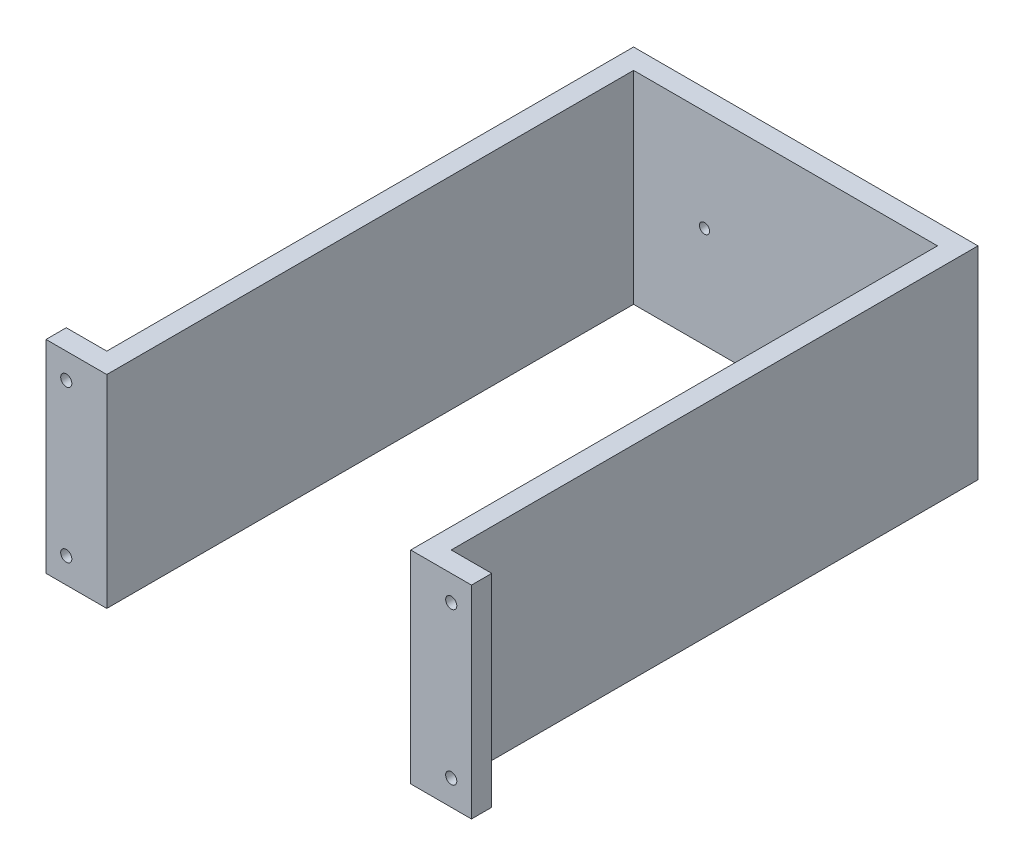
ISO-10303-21;
HEADER;
FILE_DESCRIPTION(('STEP AP214'),'2;1');
FILE_NAME('part.step','',(''),(''),'','','');
FILE_SCHEMA(('AUTOMOTIVE_DESIGN { 1 0 10303 214 1 1 1 1 }'));
ENDSEC;
DATA;
#1=APPLICATION_CONTEXT('core data for automotive mechanical design processes');
#2=APPLICATION_PROTOCOL_DEFINITION('international standard','automotive_design',2000,#1);
#3=PRODUCT_CONTEXT('',#1,'mechanical');
#4=PRODUCT('Part','Part','',(#3));
#5=PRODUCT_RELATED_PRODUCT_CATEGORY('part','',(#4));
#6=PRODUCT_DEFINITION_FORMATION('','',#4);
#7=PRODUCT_DEFINITION_CONTEXT('part definition',#1,'design');
#8=PRODUCT_DEFINITION('design','',#6,#7);
#9=PRODUCT_DEFINITION_SHAPE('','',#8);
#10=(LENGTH_UNIT() NAMED_UNIT(*) SI_UNIT(.MILLI.,.METRE.));
#11=(NAMED_UNIT(*) PLANE_ANGLE_UNIT() SI_UNIT($,.RADIAN.));
#12=(NAMED_UNIT(*) SI_UNIT($,.STERADIAN.) SOLID_ANGLE_UNIT());
#13=UNCERTAINTY_MEASURE_WITH_UNIT(LENGTH_MEASURE(1.E-05),#10,'distance_accuracy_value','');
#14=(GEOMETRIC_REPRESENTATION_CONTEXT(3) GLOBAL_UNCERTAINTY_ASSIGNED_CONTEXT((#13)) GLOBAL_UNIT_ASSIGNED_CONTEXT((#10,
#11,#12)) REPRESENTATION_CONTEXT('',''));
#15=CARTESIAN_POINT('',(0.,0.,0.));
#16=DIRECTION('',(0.,0.,1.));
#17=DIRECTION('',(1.,0.,0.));
#18=AXIS2_PLACEMENT_3D('',#15,#16,#17);
#19=CARTESIAN_POINT('',(9.99999999999999,87.5,0.));
#20=DIRECTION('',(0.,0.,-1.));
#21=DIRECTION('',(-1.,0.,0.));
#22=AXIS2_PLACEMENT_3D('',#19,#20,#21);
#23=CYLINDRICAL_SURFACE('',#22,2.75);
#24=CARTESIAN_POINT('',(9.99999999999999,87.5,0.));
#25=DIRECTION('',(0.,0.,-1.));
#26=DIRECTION('',(-1.,0.,0.));
#27=AXIS2_PLACEMENT_3D('',#24,#25,#26);
#28=CIRCLE('',#27,2.75);
#29=CARTESIAN_POINT('',(7.24999999999999,87.5,0.));
#30=VERTEX_POINT('',#29);
#31=EDGE_CURVE('E288',#30,#30,#28,.T.);
#32=ORIENTED_EDGE('',*,*,#31,.F.);
#33=EDGE_LOOP('',(#32));
#34=FACE_BOUND('',#33,.T.);
#35=CARTESIAN_POINT('',(9.99999999999999,87.5,-4.5));
#36=DIRECTION('',(0.,0.,-1.));
#37=DIRECTION('',(-1.,0.,0.));
#38=AXIS2_PLACEMENT_3D('',#35,#36,#37);
#39=CIRCLE('',#38,2.75);
#40=CARTESIAN_POINT('',(7.24999999999999,87.5,-4.5));
#41=VERTEX_POINT('',#40);
#42=EDGE_CURVE('E51',#41,#41,#39,.F.);
#43=ORIENTED_EDGE('',*,*,#42,.F.);
#44=EDGE_LOOP('',(#43));
#45=FACE_BOUND('',#44,.T.);
#46=ADVANCED_FACE('F47',(#34,#45),#23,.F.);
#47=CARTESIAN_POINT('',(10.,12.5,0.));
#48=DIRECTION('',(0.,0.,-1.));
#49=DIRECTION('',(-1.,0.,0.));
#50=AXIS2_PLACEMENT_3D('',#47,#48,#49);
#51=CYLINDRICAL_SURFACE('',#50,2.75);
#52=CARTESIAN_POINT('',(10.,12.5,0.));
#53=DIRECTION('',(0.,0.,-1.));
#54=DIRECTION('',(-1.,0.,0.));
#55=AXIS2_PLACEMENT_3D('',#52,#53,#54);
#56=CIRCLE('',#55,2.75);
#57=CARTESIAN_POINT('',(7.25000000000001,12.5,0.));
#58=VERTEX_POINT('',#57);
#59=EDGE_CURVE('E284',#58,#58,#56,.T.);
#60=ORIENTED_EDGE('',*,*,#59,.F.);
#61=EDGE_LOOP('',(#60));
#62=FACE_BOUND('',#61,.T.);
#63=CARTESIAN_POINT('',(10.,12.5,-4.5));
#64=DIRECTION('',(0.,0.,-1.));
#65=DIRECTION('',(-1.,0.,0.));
#66=AXIS2_PLACEMENT_3D('',#63,#64,#65);
#67=CIRCLE('',#66,2.75);
#68=CARTESIAN_POINT('',(7.25000000000001,12.5,-4.5));
#69=VERTEX_POINT('',#68);
#70=EDGE_CURVE('E263',#69,#69,#67,.F.);
#71=ORIENTED_EDGE('',*,*,#70,.F.);
#72=EDGE_LOOP('',(#71));
#73=FACE_BOUND('',#72,.T.);
#74=ADVANCED_FACE('F433',(#62,#73),#51,.F.);
#75=CARTESIAN_POINT('',(200.,12.5000000000001,0.));
#76=DIRECTION('',(0.,0.,-1.));
#77=DIRECTION('',(-1.,0.,0.));
#78=AXIS2_PLACEMENT_3D('',#75,#76,#77);
#79=CYLINDRICAL_SURFACE('',#78,2.75000000000001);
#80=CARTESIAN_POINT('',(200.,12.5000000000001,0.));
#81=DIRECTION('',(0.,0.,-1.));
#82=DIRECTION('',(-1.,0.,0.));
#83=AXIS2_PLACEMENT_3D('',#80,#81,#82);
#84=CIRCLE('',#83,2.75000000000001);
#85=CARTESIAN_POINT('',(197.25,12.5000000000001,0.));
#86=VERTEX_POINT('',#85);
#87=EDGE_CURVE('E277',#86,#86,#84,.T.);
#88=ORIENTED_EDGE('',*,*,#87,.F.);
#89=EDGE_LOOP('',(#88));
#90=FACE_BOUND('',#89,.T.);
#91=CARTESIAN_POINT('',(200.,12.5000000000001,-4.5));
#92=DIRECTION('',(0.,0.,-1.));
#93=DIRECTION('',(-1.,0.,0.));
#94=AXIS2_PLACEMENT_3D('',#91,#92,#93);
#95=CIRCLE('',#94,2.75000000000001);
#96=CARTESIAN_POINT('',(197.25,12.5000000000001,-4.5));
#97=VERTEX_POINT('',#96);
#98=EDGE_CURVE('E259',#97,#97,#95,.F.);
#99=ORIENTED_EDGE('',*,*,#98,.F.);
#100=EDGE_LOOP('',(#99));
#101=FACE_BOUND('',#100,.T.);
#102=ADVANCED_FACE('F439',(#90,#101),#79,.F.);
#103=CARTESIAN_POINT('',(200.,87.5,0.));
#104=DIRECTION('',(0.,0.,-1.));
#105=DIRECTION('',(-1.,0.,0.));
#106=AXIS2_PLACEMENT_3D('',#103,#104,#105);
#107=CYLINDRICAL_SURFACE('',#106,2.75000000000001);
#108=CARTESIAN_POINT('',(200.,87.5,0.));
#109=DIRECTION('',(0.,0.,-1.));
#110=DIRECTION('',(-1.,0.,0.));
#111=AXIS2_PLACEMENT_3D('',#108,#109,#110);
#112=CIRCLE('',#111,2.75000000000001);
#113=CARTESIAN_POINT('',(197.25,87.5,0.));
#114=VERTEX_POINT('',#113);
#115=EDGE_CURVE('E271',#114,#114,#112,.T.);
#116=ORIENTED_EDGE('',*,*,#115,.F.);
#117=EDGE_LOOP('',(#116));
#118=FACE_BOUND('',#117,.T.);
#119=CARTESIAN_POINT('',(200.,87.5,-4.5));
#120=DIRECTION('',(0.,0.,-1.));
#121=DIRECTION('',(-1.,0.,0.));
#122=AXIS2_PLACEMENT_3D('',#119,#120,#121);
#123=CIRCLE('',#122,2.75000000000001);
#124=CARTESIAN_POINT('',(197.25,87.5,-4.5));
#125=VERTEX_POINT('',#124);
#126=EDGE_CURVE('E255',#125,#125,#123,.F.);
#127=ORIENTED_EDGE('',*,*,#126,.F.);
#128=EDGE_LOOP('',(#127));
#129=FACE_BOUND('',#128,.T.);
#130=ADVANCED_FACE('F445',(#118,#129),#107,.F.);
#131=CARTESIAN_POINT('',(65.,50.,-270.));
#132=DIRECTION('',(0.,0.,-1.));
#133=DIRECTION('',(-1.,0.,0.));
#134=AXIS2_PLACEMENT_3D('',#131,#132,#133);
#135=CYLINDRICAL_SURFACE('',#134,2.5);
#136=CARTESIAN_POINT('',(65.,50.,-260.));
#137=DIRECTION('',(0.,0.,-1.));
#138=DIRECTION('',(-1.,0.,0.));
#139=AXIS2_PLACEMENT_3D('',#136,#137,#138);
#140=CIRCLE('',#139,2.5);
#141=CARTESIAN_POINT('',(62.5,50.,-260.));
#142=VERTEX_POINT('',#141);
#143=EDGE_CURVE('E181',#142,#142,#140,.T.);
#144=ORIENTED_EDGE('',*,*,#143,.F.);
#145=EDGE_LOOP('',(#144));
#146=FACE_BOUND('',#145,.T.);
#147=CARTESIAN_POINT('',(65.,50.,-267.4));
#148=DIRECTION('',(0.,0.,-1.));
#149=DIRECTION('',(-1.,0.,0.));
#150=AXIS2_PLACEMENT_3D('',#147,#148,#149);
#151=CIRCLE('',#150,2.5);
#152=CARTESIAN_POINT('',(62.5,50.,-267.4));
#153=VERTEX_POINT('',#152);
#154=EDGE_CURVE('E249',#153,#153,#151,.F.);
#155=ORIENTED_EDGE('',*,*,#154,.F.);
#156=EDGE_LOOP('',(#155));
#157=FACE_BOUND('',#156,.T.);
#158=ADVANCED_FACE('F468',(#146,#157),#135,.F.);
#159=CARTESIAN_POINT('',(145.,50.0000000000001,-270.));
#160=DIRECTION('',(0.,0.,-1.));
#161=DIRECTION('',(-1.,0.,0.));
#162=AXIS2_PLACEMENT_3D('',#159,#160,#161);
#163=CYLINDRICAL_SURFACE('',#162,2.5);
#164=CARTESIAN_POINT('',(145.,50.0000000000001,-260.));
#165=DIRECTION('',(0.,0.,-1.));
#166=DIRECTION('',(-1.,0.,0.));
#167=AXIS2_PLACEMENT_3D('',#164,#165,#166);
#168=CIRCLE('',#167,2.5);
#169=CARTESIAN_POINT('',(142.5,50.0000000000001,-260.));
#170=VERTEX_POINT('',#169);
#171=EDGE_CURVE('E254',#170,#170,#168,.T.);
#172=ORIENTED_EDGE('',*,*,#171,.F.);
#173=EDGE_LOOP('',(#172));
#174=FACE_BOUND('',#173,.T.);
#175=CARTESIAN_POINT('',(145.,50.0000000000001,-267.4));
#176=DIRECTION('',(0.,0.,-1.));
#177=DIRECTION('',(-1.,0.,0.));
#178=AXIS2_PLACEMENT_3D('',#175,#176,#177);
#179=CIRCLE('',#178,2.5);
#180=CARTESIAN_POINT('',(142.5,50.0000000000001,-267.4));
#181=VERTEX_POINT('',#180);
#182=EDGE_CURVE('E245',#181,#181,#179,.F.);
#183=ORIENTED_EDGE('',*,*,#182,.F.);
#184=EDGE_LOOP('',(#183));
#185=FACE_BOUND('',#184,.T.);
#186=ADVANCED_FACE('F465',(#174,#185),#163,.F.);
#187=CARTESIAN_POINT('',(0.,100.,0.));
#188=DIRECTION('',(1.,0.,0.));
#189=DIRECTION('',(0.,0.,-1.));
#190=AXIS2_PLACEMENT_3D('',#187,#188,#189);
#191=PLANE('',#190);
#192=DIRECTION('',(0.,0.,1.));
#193=VECTOR('',#192,1.);
#194=CARTESIAN_POINT('',(0.,0.,0.));
#195=LINE('',#194,#193);
#196=CARTESIAN_POINT('',(0.,0.,-10.));
#197=VERTEX_POINT('',#196);
#198=CARTESIAN_POINT('',(0.,0.,0.));
#199=VERTEX_POINT('',#198);
#200=EDGE_CURVE('E176',#197,#199,#195,.T.);
#201=ORIENTED_EDGE('',*,*,#200,.T.);
#202=DIRECTION('',(0.,-1.,0.));
#203=VECTOR('',#202,1.);
#204=CARTESIAN_POINT('',(0.,100.,0.));
#205=LINE('',#204,#203);
#206=CARTESIAN_POINT('',(0.,100.,0.));
#207=VERTEX_POINT('',#206);
#208=EDGE_CURVE('E11',#207,#199,#205,.T.);
#209=ORIENTED_EDGE('',*,*,#208,.F.);
#210=DIRECTION('',(0.,0.,1.));
#211=VECTOR('',#210,1.);
#212=CARTESIAN_POINT('',(0.,100.,0.));
#213=LINE('',#212,#211);
#214=CARTESIAN_POINT('',(0.,100.,-10.));
#215=VERTEX_POINT('',#214);
#216=EDGE_CURVE('E211',#215,#207,#213,.T.);
#217=ORIENTED_EDGE('',*,*,#216,.F.);
#218=DIRECTION('',(0.,-1.,0.));
#219=VECTOR('',#218,1.);
#220=CARTESIAN_POINT('',(0.,100.,-10.));
#221=LINE('',#220,#219);
#222=EDGE_CURVE('E172',#215,#197,#221,.T.);
#223=ORIENTED_EDGE('',*,*,#222,.T.);
#224=EDGE_LOOP('',(#201,#209,#217,#223));
#225=FACE_BOUND('',#224,.T.);
#226=ADVANCED_FACE('F49',(#225),#191,.F.);
#227=CARTESIAN_POINT('',(0.,100.,0.));
#228=DIRECTION('',(0.,0.,-1.));
#229=DIRECTION('',(-1.,0.,0.));
#230=AXIS2_PLACEMENT_3D('',#227,#228,#229);
#231=PLANE('',#230);
#232=ORIENTED_EDGE('',*,*,#59,.T.);
#233=EDGE_LOOP('',(#232));
#234=FACE_BOUND('',#233,.T.);
#235=ORIENTED_EDGE('',*,*,#31,.T.);
#236=EDGE_LOOP('',(#235));
#237=FACE_BOUND('',#236,.T.);
#238=DIRECTION('',(1.,0.,0.));
#239=VECTOR('',#238,1.);
#240=CARTESIAN_POINT('',(0.,0.,0.));
#241=LINE('',#240,#239);
#242=CARTESIAN_POINT('',(30.,0.,0.));
#243=VERTEX_POINT('',#242);
#244=EDGE_CURVE('E180',#199,#243,#241,.T.);
#245=ORIENTED_EDGE('',*,*,#244,.T.);
#246=DIRECTION('',(0.,-1.,0.));
#247=VECTOR('',#246,1.);
#248=CARTESIAN_POINT('',(30.,100.,0.));
#249=LINE('',#248,#247);
#250=CARTESIAN_POINT('',(30.,100.,0.));
#251=VERTEX_POINT('',#250);
#252=EDGE_CURVE('E58',#251,#243,#249,.T.);
#253=ORIENTED_EDGE('',*,*,#252,.F.);
#254=DIRECTION('',(1.,0.,0.));
#255=VECTOR('',#254,1.);
#256=CARTESIAN_POINT('',(0.,100.,0.));
#257=LINE('',#256,#255);
#258=EDGE_CURVE('E122',#207,#251,#257,.T.);
#259=ORIENTED_EDGE('',*,*,#258,.F.);
#260=ORIENTED_EDGE('',*,*,#208,.T.);
#261=EDGE_LOOP('',(#245,#253,#259,#260));
#262=FACE_BOUND('',#261,.T.);
#263=ADVANCED_FACE('F508',(#234,#237,#262),#231,.F.);
#264=CARTESIAN_POINT('',(30.,100.,0.));
#265=DIRECTION('',(-1.,0.,0.));
#266=DIRECTION('',(0.,0.,1.));
#267=AXIS2_PLACEMENT_3D('',#264,#265,#266);
#268=PLANE('',#267);
#269=DIRECTION('',(0.,0.,-1.));
#270=VECTOR('',#269,1.);
#271=CARTESIAN_POINT('',(30.,0.,0.));
#272=LINE('',#271,#270);
#273=CARTESIAN_POINT('',(30.,0.,-260.));
#274=VERTEX_POINT('',#273);
#275=EDGE_CURVE('E184',#243,#274,#272,.T.);
#276=ORIENTED_EDGE('',*,*,#275,.T.);
#277=DIRECTION('',(0.,-1.,0.));
#278=VECTOR('',#277,1.);
#279=CARTESIAN_POINT('',(30.,100.,-260.));
#280=LINE('',#279,#278);
#281=CARTESIAN_POINT('',(30.,100.,-260.));
#282=VERTEX_POINT('',#281);
#283=EDGE_CURVE('E238',#282,#274,#280,.T.);
#284=ORIENTED_EDGE('',*,*,#283,.F.);
#285=DIRECTION('',(0.,0.,-1.));
#286=VECTOR('',#285,1.);
#287=CARTESIAN_POINT('',(30.,100.,0.));
#288=LINE('',#287,#286);
#289=EDGE_CURVE('E317',#251,#282,#288,.T.);
#290=ORIENTED_EDGE('',*,*,#289,.F.);
#291=ORIENTED_EDGE('',*,*,#252,.T.);
#292=EDGE_LOOP('',(#276,#284,#290,#291));
#293=FACE_BOUND('',#292,.T.);
#294=ADVANCED_FACE('F505',(#293),#268,.F.);
#295=CARTESIAN_POINT('',(30.,100.,-260.));
#296=DIRECTION('',(0.,0.,-1.));
#297=DIRECTION('',(-1.,0.,0.));
#298=AXIS2_PLACEMENT_3D('',#295,#296,#297);
#299=PLANE('',#298);
#300=ORIENTED_EDGE('',*,*,#171,.T.);
#301=EDGE_LOOP('',(#300));
#302=FACE_BOUND('',#301,.T.);
#303=ORIENTED_EDGE('',*,*,#143,.T.);
#304=EDGE_LOOP('',(#303));
#305=FACE_BOUND('',#304,.T.);
#306=DIRECTION('',(1.,0.,0.));
#307=VECTOR('',#306,1.);
#308=CARTESIAN_POINT('',(30.,0.,-260.));
#309=LINE('',#308,#307);
#310=CARTESIAN_POINT('',(180.,0.,-260.));
#311=VERTEX_POINT('',#310);
#312=EDGE_CURVE('E187',#274,#311,#309,.T.);
#313=ORIENTED_EDGE('',*,*,#312,.T.);
#314=DIRECTION('',(0.,-1.,0.));
#315=VECTOR('',#314,1.);
#316=CARTESIAN_POINT('',(180.,100.,-260.));
#317=LINE('',#316,#315);
#318=CARTESIAN_POINT('',(180.,100.,-260.));
#319=VERTEX_POINT('',#318);
#320=EDGE_CURVE('E234',#319,#311,#317,.T.);
#321=ORIENTED_EDGE('',*,*,#320,.F.);
#322=DIRECTION('',(1.,0.,0.));
#323=VECTOR('',#322,1.);
#324=CARTESIAN_POINT('',(30.,100.,-260.));
#325=LINE('',#324,#323);
#326=EDGE_CURVE('E320',#282,#319,#325,.T.);
#327=ORIENTED_EDGE('',*,*,#326,.F.);
#328=ORIENTED_EDGE('',*,*,#283,.T.);
#329=EDGE_LOOP('',(#313,#321,#327,#328));
#330=FACE_BOUND('',#329,.T.);
#331=ADVANCED_FACE('F501',(#302,#305,#330),#299,.F.);
#332=CARTESIAN_POINT('',(180.,100.,-260.));
#333=DIRECTION('',(1.,0.,0.));
#334=DIRECTION('',(0.,0.,-1.));
#335=AXIS2_PLACEMENT_3D('',#332,#333,#334);
#336=PLANE('',#335);
#337=DIRECTION('',(0.,0.,1.));
#338=VECTOR('',#337,1.);
#339=CARTESIAN_POINT('',(180.,0.,-260.));
#340=LINE('',#339,#338);
#341=CARTESIAN_POINT('',(180.,0.,0.));
#342=VERTEX_POINT('',#341);
#343=EDGE_CURVE('E190',#311,#342,#340,.T.);
#344=ORIENTED_EDGE('',*,*,#343,.T.);
#345=DIRECTION('',(0.,-1.,0.));
#346=VECTOR('',#345,1.);
#347=CARTESIAN_POINT('',(180.,100.,0.));
#348=LINE('',#347,#346);
#349=CARTESIAN_POINT('',(180.,100.,0.));
#350=VERTEX_POINT('',#349);
#351=EDGE_CURVE('E230',#350,#342,#348,.T.);
#352=ORIENTED_EDGE('',*,*,#351,.F.);
#353=DIRECTION('',(0.,0.,1.));
#354=VECTOR('',#353,1.);
#355=CARTESIAN_POINT('',(180.,100.,-260.));
#356=LINE('',#355,#354);
#357=EDGE_CURVE('E323',#319,#350,#356,.T.);
#358=ORIENTED_EDGE('',*,*,#357,.F.);
#359=ORIENTED_EDGE('',*,*,#320,.T.);
#360=EDGE_LOOP('',(#344,#352,#358,#359));
#361=FACE_BOUND('',#360,.T.);
#362=ADVANCED_FACE('F498',(#361),#336,.F.);
#363=CARTESIAN_POINT('',(180.,100.,0.));
#364=DIRECTION('',(0.,0.,-1.));
#365=DIRECTION('',(-1.,0.,0.));
#366=AXIS2_PLACEMENT_3D('',#363,#364,#365);
#367=PLANE('',#366);
#368=ORIENTED_EDGE('',*,*,#115,.T.);
#369=EDGE_LOOP('',(#368));
#370=FACE_BOUND('',#369,.T.);
#371=ORIENTED_EDGE('',*,*,#87,.T.);
#372=EDGE_LOOP('',(#371));
#373=FACE_BOUND('',#372,.T.);
#374=DIRECTION('',(1.,0.,0.));
#375=VECTOR('',#374,1.);
#376=CARTESIAN_POINT('',(180.,0.,0.));
#377=LINE('',#376,#375);
#378=CARTESIAN_POINT('',(210.,0.,0.));
#379=VERTEX_POINT('',#378);
#380=EDGE_CURVE('E193',#342,#379,#377,.T.);
#381=ORIENTED_EDGE('',*,*,#380,.T.);
#382=DIRECTION('',(0.,-1.,0.));
#383=VECTOR('',#382,1.);
#384=CARTESIAN_POINT('',(210.,100.,0.));
#385=LINE('',#384,#383);
#386=CARTESIAN_POINT('',(210.,100.,0.));
#387=VERTEX_POINT('',#386);
#388=EDGE_CURVE('E226',#387,#379,#385,.T.);
#389=ORIENTED_EDGE('',*,*,#388,.F.);
#390=DIRECTION('',(1.,0.,0.));
#391=VECTOR('',#390,1.);
#392=CARTESIAN_POINT('',(180.,100.,0.));
#393=LINE('',#392,#391);
#394=EDGE_CURVE('E326',#350,#387,#393,.T.);
#395=ORIENTED_EDGE('',*,*,#394,.F.);
#396=ORIENTED_EDGE('',*,*,#351,.T.);
#397=EDGE_LOOP('',(#381,#389,#395,#396));
#398=FACE_BOUND('',#397,.T.);
#399=ADVANCED_FACE('F494',(#370,#373,#398),#367,.F.);
#400=CARTESIAN_POINT('',(210.,100.,0.));
#401=DIRECTION('',(-1.,0.,0.));
#402=DIRECTION('',(0.,0.,1.));
#403=AXIS2_PLACEMENT_3D('',#400,#401,#402);
#404=PLANE('',#403);
#405=DIRECTION('',(0.,0.,-1.));
#406=VECTOR('',#405,1.);
#407=CARTESIAN_POINT('',(210.,0.,0.));
#408=LINE('',#407,#406);
#409=CARTESIAN_POINT('',(210.,0.,-10.));
#410=VERTEX_POINT('',#409);
#411=EDGE_CURVE('E196',#379,#410,#408,.T.);
#412=ORIENTED_EDGE('',*,*,#411,.T.);
#413=DIRECTION('',(0.,-1.,0.));
#414=VECTOR('',#413,1.);
#415=CARTESIAN_POINT('',(210.,100.,-10.));
#416=LINE('',#415,#414);
#417=CARTESIAN_POINT('',(210.,100.,-10.));
#418=VERTEX_POINT('',#417);
#419=EDGE_CURVE('E222',#418,#410,#416,.T.);
#420=ORIENTED_EDGE('',*,*,#419,.F.);
#421=DIRECTION('',(0.,0.,-1.));
#422=VECTOR('',#421,1.);
#423=CARTESIAN_POINT('',(210.,100.,0.));
#424=LINE('',#423,#422);
#425=EDGE_CURVE('E329',#387,#418,#424,.T.);
#426=ORIENTED_EDGE('',*,*,#425,.F.);
#427=ORIENTED_EDGE('',*,*,#388,.T.);
#428=EDGE_LOOP('',(#412,#420,#426,#427));
#429=FACE_BOUND('',#428,.T.);
#430=ADVANCED_FACE('F490',(#429),#404,.F.);
#431=CARTESIAN_POINT('',(190.,100.,-10.));
#432=DIRECTION('',(0.,0.,1.));
#433=DIRECTION('',(1.,0.,0.));
#434=AXIS2_PLACEMENT_3D('',#431,#432,#433);
#435=PLANE('',#434);
#436=CARTESIAN_POINT('',(200.,87.5,-10.));
#437=DIRECTION('',(0.,0.,-1.));
#438=DIRECTION('',(-1.,0.,0.));
#439=AXIS2_PLACEMENT_3D('',#436,#437,#438);
#440=CIRCLE('',#439,5.50000000000002);
#441=CARTESIAN_POINT('',(194.5,87.5,-10.));
#442=VERTEX_POINT('',#441);
#443=EDGE_CURVE('E381',#442,#442,#440,.T.);
#444=ORIENTED_EDGE('',*,*,#443,.F.);
#445=EDGE_LOOP('',(#444));
#446=FACE_BOUND('',#445,.T.);
#447=CARTESIAN_POINT('',(200.,12.5000000000001,-10.));
#448=DIRECTION('',(0.,0.,-1.));
#449=DIRECTION('',(-1.,0.,0.));
#450=AXIS2_PLACEMENT_3D('',#447,#448,#449);
#451=CIRCLE('',#450,5.50000000000002);
#452=CARTESIAN_POINT('',(194.5,12.5000000000001,-10.));
#453=VERTEX_POINT('',#452);
#454=EDGE_CURVE('E389',#453,#453,#451,.T.);
#455=ORIENTED_EDGE('',*,*,#454,.F.);
#456=EDGE_LOOP('',(#455));
#457=FACE_BOUND('',#456,.T.);
#458=DIRECTION('',(-1.,0.,0.));
#459=VECTOR('',#458,1.);
#460=CARTESIAN_POINT('',(190.,0.,-10.));
#461=LINE('',#460,#459);
#462=CARTESIAN_POINT('',(190.,0.,-10.));
#463=VERTEX_POINT('',#462);
#464=EDGE_CURVE('E199',#410,#463,#461,.T.);
#465=ORIENTED_EDGE('',*,*,#464,.T.);
#466=DIRECTION('',(0.,-1.,0.));
#467=VECTOR('',#466,1.);
#468=CARTESIAN_POINT('',(190.,100.,-10.));
#469=LINE('',#468,#467);
#470=CARTESIAN_POINT('',(190.,100.,-10.));
#471=VERTEX_POINT('',#470);
#472=EDGE_CURVE('E218',#471,#463,#469,.T.);
#473=ORIENTED_EDGE('',*,*,#472,.F.);
#474=DIRECTION('',(-1.,0.,0.));
#475=VECTOR('',#474,1.);
#476=CARTESIAN_POINT('',(190.,100.,-10.));
#477=LINE('',#476,#475);
#478=EDGE_CURVE('E332',#418,#471,#477,.T.);
#479=ORIENTED_EDGE('',*,*,#478,.F.);
#480=ORIENTED_EDGE('',*,*,#419,.T.);
#481=EDGE_LOOP('',(#465,#473,#479,#480));
#482=FACE_BOUND('',#481,.T.);
#483=ADVANCED_FACE('F486',(#446,#457,#482),#435,.F.);
#484=CARTESIAN_POINT('',(190.,100.,-270.));
#485=DIRECTION('',(-1.,0.,0.));
#486=DIRECTION('',(0.,0.,1.));
#487=AXIS2_PLACEMENT_3D('',#484,#485,#486);
#488=PLANE('',#487);
#489=DIRECTION('',(0.,0.,-1.));
#490=VECTOR('',#489,1.);
#491=CARTESIAN_POINT('',(190.,0.,-270.));
#492=LINE('',#491,#490);
#493=CARTESIAN_POINT('',(190.,0.,-270.));
#494=VERTEX_POINT('',#493);
#495=EDGE_CURVE('E202',#463,#494,#492,.T.);
#496=ORIENTED_EDGE('',*,*,#495,.T.);
#497=DIRECTION('',(0.,-1.,0.));
#498=VECTOR('',#497,1.);
#499=CARTESIAN_POINT('',(190.,100.,-270.));
#500=LINE('',#499,#498);
#501=CARTESIAN_POINT('',(190.,100.,-270.));
#502=VERTEX_POINT('',#501);
#503=EDGE_CURVE('E164',#502,#494,#500,.T.);
#504=ORIENTED_EDGE('',*,*,#503,.F.);
#505=DIRECTION('',(0.,0.,-1.));
#506=VECTOR('',#505,1.);
#507=CARTESIAN_POINT('',(190.,100.,-270.));
#508=LINE('',#507,#506);
#509=EDGE_CURVE('E153',#471,#502,#508,.T.);
#510=ORIENTED_EDGE('',*,*,#509,.F.);
#511=ORIENTED_EDGE('',*,*,#472,.T.);
#512=EDGE_LOOP('',(#496,#504,#510,#511));
#513=FACE_BOUND('',#512,.T.);
#514=ADVANCED_FACE('F482',(#513),#488,.F.);
#515=CARTESIAN_POINT('',(20.,100.,-270.));
#516=DIRECTION('',(0.,0.,1.));
#517=DIRECTION('',(1.,0.,0.));
#518=AXIS2_PLACEMENT_3D('',#515,#516,#517);
#519=PLANE('',#518);
#520=CARTESIAN_POINT('',(145.,50.0000000000001,-270.));
#521=DIRECTION('',(0.,0.,-1.));
#522=DIRECTION('',(-1.,0.,0.));
#523=AXIS2_PLACEMENT_3D('',#520,#521,#522);
#524=CIRCLE('',#523,6.00000000000002);
#525=CARTESIAN_POINT('',(139.,50.0000000000001,-270.));
#526=VERTEX_POINT('',#525);
#527=EDGE_CURVE('E296',#526,#526,#524,.T.);
#528=ORIENTED_EDGE('',*,*,#527,.F.);
#529=EDGE_LOOP('',(#528));
#530=FACE_BOUND('',#529,.T.);
#531=CARTESIAN_POINT('',(65.,50.,-270.));
#532=DIRECTION('',(0.,0.,-1.));
#533=DIRECTION('',(-1.,0.,0.));
#534=AXIS2_PLACEMENT_3D('',#531,#532,#533);
#535=CIRCLE('',#534,6.);
#536=CARTESIAN_POINT('',(59.,50.,-270.));
#537=VERTEX_POINT('',#536);
#538=EDGE_CURVE('E292',#537,#537,#535,.T.);
#539=ORIENTED_EDGE('',*,*,#538,.F.);
#540=EDGE_LOOP('',(#539));
#541=FACE_BOUND('',#540,.T.);
#542=DIRECTION('',(-1.,0.,0.));
#543=VECTOR('',#542,1.);
#544=CARTESIAN_POINT('',(20.,0.,-270.));
#545=LINE('',#544,#543);
#546=CARTESIAN_POINT('',(20.,0.,-270.));
#547=VERTEX_POINT('',#546);
#548=EDGE_CURVE('E162',#494,#547,#545,.T.);
#549=ORIENTED_EDGE('',*,*,#548,.T.);
#550=DIRECTION('',(0.,-1.,0.));
#551=VECTOR('',#550,1.);
#552=CARTESIAN_POINT('',(20.,100.,-270.));
#553=LINE('',#552,#551);
#554=CARTESIAN_POINT('',(20.,100.,-270.));
#555=VERTEX_POINT('',#554);
#556=EDGE_CURVE('E159',#555,#547,#553,.T.);
#557=ORIENTED_EDGE('',*,*,#556,.F.);
#558=DIRECTION('',(-1.,0.,0.));
#559=VECTOR('',#558,1.);
#560=CARTESIAN_POINT('',(20.,100.,-270.));
#561=LINE('',#560,#559);
#562=EDGE_CURVE('E147',#502,#555,#561,.T.);
#563=ORIENTED_EDGE('',*,*,#562,.F.);
#564=ORIENTED_EDGE('',*,*,#503,.T.);
#565=EDGE_LOOP('',(#549,#557,#563,#564));
#566=FACE_BOUND('',#565,.T.);
#567=ADVANCED_FACE('F160',(#530,#541,#566),#519,.F.);
#568=CARTESIAN_POINT('',(20.,100.,-10.));
#569=DIRECTION('',(1.,0.,0.));
#570=DIRECTION('',(0.,0.,-1.));
#571=AXIS2_PLACEMENT_3D('',#568,#569,#570);
#572=PLANE('',#571);
#573=DIRECTION('',(0.,0.,1.));
#574=VECTOR('',#573,1.);
#575=CARTESIAN_POINT('',(20.,0.,-10.));
#576=LINE('',#575,#574);
#577=CARTESIAN_POINT('',(20.,0.,-10.));
#578=VERTEX_POINT('',#577);
#579=EDGE_CURVE('E108',#547,#578,#576,.T.);
#580=ORIENTED_EDGE('',*,*,#579,.T.);
#581=DIRECTION('',(0.,-1.,0.));
#582=VECTOR('',#581,1.);
#583=CARTESIAN_POINT('',(20.,100.,-10.));
#584=LINE('',#583,#582);
#585=CARTESIAN_POINT('',(20.,100.,-10.));
#586=VERTEX_POINT('',#585);
#587=EDGE_CURVE('E165',#586,#578,#584,.T.);
#588=ORIENTED_EDGE('',*,*,#587,.F.);
#589=DIRECTION('',(0.,0.,1.));
#590=VECTOR('',#589,1.);
#591=CARTESIAN_POINT('',(20.,100.,-10.));
#592=LINE('',#591,#590);
#593=EDGE_CURVE('E151',#555,#586,#592,.T.);
#594=ORIENTED_EDGE('',*,*,#593,.F.);
#595=ORIENTED_EDGE('',*,*,#556,.T.);
#596=EDGE_LOOP('',(#580,#588,#594,#595));
#597=FACE_BOUND('',#596,.T.);
#598=ADVANCED_FACE('F167',(#597),#572,.F.);
#599=CARTESIAN_POINT('',(0.,100.,-10.));
#600=DIRECTION('',(0.,0.,1.));
#601=DIRECTION('',(1.,0.,0.));
#602=AXIS2_PLACEMENT_3D('',#599,#600,#601);
#603=PLANE('',#602);
#604=CARTESIAN_POINT('',(10.,12.5,-10.));
#605=DIRECTION('',(0.,0.,-1.));
#606=DIRECTION('',(-1.,0.,0.));
#607=AXIS2_PLACEMENT_3D('',#604,#605,#606);
#608=CIRCLE('',#607,5.5);
#609=CARTESIAN_POINT('',(4.50000000000001,12.5,-10.));
#610=VERTEX_POINT('',#609);
#611=EDGE_CURVE('E397',#610,#610,#608,.T.);
#612=ORIENTED_EDGE('',*,*,#611,.F.);
#613=EDGE_LOOP('',(#612));
#614=FACE_BOUND('',#613,.T.);
#615=CARTESIAN_POINT('',(9.99999999999999,87.5,-10.));
#616=DIRECTION('',(0.,0.,-1.));
#617=DIRECTION('',(-1.,0.,0.));
#618=AXIS2_PLACEMENT_3D('',#615,#616,#617);
#619=CIRCLE('',#618,5.5);
#620=CARTESIAN_POINT('',(4.49999999999999,87.5,-10.));
#621=VERTEX_POINT('',#620);
#622=EDGE_CURVE('E373',#621,#621,#619,.T.);
#623=ORIENTED_EDGE('',*,*,#622,.F.);
#624=EDGE_LOOP('',(#623));
#625=FACE_BOUND('',#624,.T.);
#626=DIRECTION('',(-1.,0.,0.));
#627=VECTOR('',#626,1.);
#628=CARTESIAN_POINT('',(0.,0.,-10.));
#629=LINE('',#628,#627);
#630=EDGE_CURVE('E114',#578,#197,#629,.T.);
#631=ORIENTED_EDGE('',*,*,#630,.T.);
#632=ORIENTED_EDGE('',*,*,#222,.F.);
#633=DIRECTION('',(-1.,0.,0.));
#634=VECTOR('',#633,1.);
#635=CARTESIAN_POINT('',(0.,100.,-10.));
#636=LINE('',#635,#634);
#637=EDGE_CURVE('E67',#586,#215,#636,.T.);
#638=ORIENTED_EDGE('',*,*,#637,.F.);
#639=ORIENTED_EDGE('',*,*,#587,.T.);
#640=EDGE_LOOP('',(#631,#632,#638,#639));
#641=FACE_BOUND('',#640,.T.);
#642=ADVANCED_FACE('F415',(#614,#625,#641),#603,.F.);
#643=CARTESIAN_POINT('',(0.,100.,0.));
#644=DIRECTION('',(0.,-1.,0.));
#645=DIRECTION('',(0.,0.,-1.));
#646=AXIS2_PLACEMENT_3D('',#643,#644,#645);
#647=PLANE('',#646);
#648=ORIENTED_EDGE('',*,*,#216,.T.);
#649=ORIENTED_EDGE('',*,*,#258,.T.);
#650=ORIENTED_EDGE('',*,*,#289,.T.);
#651=ORIENTED_EDGE('',*,*,#326,.T.);
#652=ORIENTED_EDGE('',*,*,#357,.T.);
#653=ORIENTED_EDGE('',*,*,#394,.T.);
#654=ORIENTED_EDGE('',*,*,#425,.T.);
#655=ORIENTED_EDGE('',*,*,#478,.T.);
#656=ORIENTED_EDGE('',*,*,#509,.T.);
#657=ORIENTED_EDGE('',*,*,#562,.T.);
#658=ORIENTED_EDGE('',*,*,#593,.T.);
#659=ORIENTED_EDGE('',*,*,#637,.T.);
#660=EDGE_LOOP('',(#648,#649,#650,#651,#652,#653,#654,#655,#656,#657,#658,#659));
#661=FACE_BOUND('',#660,.T.);
#662=ADVANCED_FACE('F149',(#661),#647,.F.);
#663=CARTESIAN_POINT('',(0.,0.,0.));
#664=DIRECTION('',(0.,-1.,0.));
#665=DIRECTION('',(0.,0.,-1.));
#666=AXIS2_PLACEMENT_3D('',#663,#664,#665);
#667=PLANE('',#666);
#668=ORIENTED_EDGE('',*,*,#200,.F.);
#669=ORIENTED_EDGE('',*,*,#630,.F.);
#670=ORIENTED_EDGE('',*,*,#579,.F.);
#671=ORIENTED_EDGE('',*,*,#548,.F.);
#672=ORIENTED_EDGE('',*,*,#495,.F.);
#673=ORIENTED_EDGE('',*,*,#464,.F.);
#674=ORIENTED_EDGE('',*,*,#411,.F.);
#675=ORIENTED_EDGE('',*,*,#380,.F.);
#676=ORIENTED_EDGE('',*,*,#343,.F.);
#677=ORIENTED_EDGE('',*,*,#312,.F.);
#678=ORIENTED_EDGE('',*,*,#275,.F.);
#679=ORIENTED_EDGE('',*,*,#244,.F.);
#680=EDGE_LOOP('',(#668,#669,#670,#671,#672,#673,#674,#675,#676,#677,#678,#679));
#681=FACE_BOUND('',#680,.T.);
#682=ADVANCED_FACE('F451',(#681),#667,.T.);
#683=CARTESIAN_POINT('',(145.,50.0000000000001,-267.4));
#684=DIRECTION('',(0.,0.,-1.));
#685=DIRECTION('',(-1.,0.,0.));
#686=AXIS2_PLACEMENT_3D('',#683,#684,#685);
#687=PLANE('',#686);
#688=CARTESIAN_POINT('',(145.,50.0000000000001,-267.4));
#689=DIRECTION('',(0.,0.,-1.));
#690=DIRECTION('',(-1.,0.,0.));
#691=AXIS2_PLACEMENT_3D('',#688,#689,#690);
#692=CIRCLE('',#691,6.00000000000002);
#693=CARTESIAN_POINT('',(139.,50.0000000000001,-267.4));
#694=VERTEX_POINT('',#693);
#695=EDGE_CURVE('E250',#694,#694,#692,.T.);
#696=ORIENTED_EDGE('',*,*,#695,.T.);
#697=EDGE_LOOP('',(#696));
#698=FACE_BOUND('',#697,.T.);
#699=ORIENTED_EDGE('',*,*,#182,.T.);
#700=EDGE_LOOP('',(#699));
#701=FACE_BOUND('',#700,.T.);
#702=ADVANCED_FACE('F447',(#698,#701),#687,.T.);
#703=CARTESIAN_POINT('',(145.,50.0000000000001,-267.4));
#704=DIRECTION('',(0.,0.,-1.));
#705=DIRECTION('',(-1.,0.,0.));
#706=AXIS2_PLACEMENT_3D('',#703,#704,#705);
#707=CYLINDRICAL_SURFACE('',#706,6.00000000000002);
#708=ORIENTED_EDGE('',*,*,#695,.F.);
#709=EDGE_LOOP('',(#708));
#710=FACE_BOUND('',#709,.T.);
#711=ORIENTED_EDGE('',*,*,#527,.T.);
#712=EDGE_LOOP('',(#711));
#713=FACE_BOUND('',#712,.T.);
#714=ADVANCED_FACE('F450',(#710,#713),#707,.F.);
#715=CARTESIAN_POINT('',(65.,50.,-267.4));
#716=DIRECTION('',(0.,0.,-1.));
#717=DIRECTION('',(-1.,0.,0.));
#718=AXIS2_PLACEMENT_3D('',#715,#716,#717);
#719=PLANE('',#718);
#720=CARTESIAN_POINT('',(65.,50.,-267.4));
#721=DIRECTION('',(0.,0.,-1.));
#722=DIRECTION('',(-1.,0.,0.));
#723=AXIS2_PLACEMENT_3D('',#720,#721,#722);
#724=CIRCLE('',#723,6.);
#725=CARTESIAN_POINT('',(59.,50.,-267.4));
#726=VERTEX_POINT('',#725);
#727=EDGE_CURVE('E300',#726,#726,#724,.T.);
#728=ORIENTED_EDGE('',*,*,#727,.T.);
#729=EDGE_LOOP('',(#728));
#730=FACE_BOUND('',#729,.T.);
#731=ORIENTED_EDGE('',*,*,#154,.T.);
#732=EDGE_LOOP('',(#731));
#733=FACE_BOUND('',#732,.T.);
#734=ADVANCED_FACE('F455',(#730,#733),#719,.T.);
#735=CARTESIAN_POINT('',(65.,50.,-267.4));
#736=DIRECTION('',(0.,0.,-1.));
#737=DIRECTION('',(-1.,0.,0.));
#738=AXIS2_PLACEMENT_3D('',#735,#736,#737);
#739=CYLINDRICAL_SURFACE('',#738,6.);
#740=ORIENTED_EDGE('',*,*,#727,.F.);
#741=EDGE_LOOP('',(#740));
#742=FACE_BOUND('',#741,.T.);
#743=ORIENTED_EDGE('',*,*,#538,.T.);
#744=EDGE_LOOP('',(#743));
#745=FACE_BOUND('',#744,.T.);
#746=ADVANCED_FACE('F459',(#742,#745),#739,.F.);
#747=CARTESIAN_POINT('',(200.,87.5,-4.5));
#748=DIRECTION('',(0.,0.,-1.));
#749=DIRECTION('',(-1.,0.,0.));
#750=AXIS2_PLACEMENT_3D('',#747,#748,#749);
#751=PLANE('',#750);
#752=CARTESIAN_POINT('',(200.,87.5,-4.5));
#753=DIRECTION('',(0.,0.,-1.));
#754=DIRECTION('',(-1.,0.,0.));
#755=AXIS2_PLACEMENT_3D('',#752,#753,#754);
#756=CIRCLE('',#755,5.50000000000002);
#757=CARTESIAN_POINT('',(194.5,87.5,-4.5));
#758=VERTEX_POINT('',#757);
#759=EDGE_CURVE('E385',#758,#758,#756,.T.);
#760=ORIENTED_EDGE('',*,*,#759,.T.);
#761=EDGE_LOOP('',(#760));
#762=FACE_BOUND('',#761,.T.);
#763=ORIENTED_EDGE('',*,*,#126,.T.);
#764=EDGE_LOOP('',(#763));
#765=FACE_BOUND('',#764,.T.);
#766=ADVANCED_FACE('F463',(#762,#765),#751,.T.);
#767=CARTESIAN_POINT('',(200.,87.5,-4.5));
#768=DIRECTION('',(0.,0.,-1.));
#769=DIRECTION('',(-1.,0.,0.));
#770=AXIS2_PLACEMENT_3D('',#767,#768,#769);
#771=CYLINDRICAL_SURFACE('',#770,5.50000000000002);
#772=ORIENTED_EDGE('',*,*,#759,.F.);
#773=EDGE_LOOP('',(#772));
#774=FACE_BOUND('',#773,.T.);
#775=ORIENTED_EDGE('',*,*,#443,.T.);
#776=EDGE_LOOP('',(#775));
#777=FACE_BOUND('',#776,.T.);
#778=ADVANCED_FACE('F581',(#774,#777),#771,.F.);
#779=CARTESIAN_POINT('',(200.,12.5000000000001,-4.5));
#780=DIRECTION('',(0.,0.,-1.));
#781=DIRECTION('',(-1.,0.,0.));
#782=AXIS2_PLACEMENT_3D('',#779,#780,#781);
#783=PLANE('',#782);
#784=CARTESIAN_POINT('',(200.,12.5000000000001,-4.5));
#785=DIRECTION('',(0.,0.,-1.));
#786=DIRECTION('',(-1.,0.,0.));
#787=AXIS2_PLACEMENT_3D('',#784,#785,#786);
#788=CIRCLE('',#787,5.50000000000002);
#789=CARTESIAN_POINT('',(194.5,12.5000000000001,-4.5));
#790=VERTEX_POINT('',#789);
#791=EDGE_CURVE('E393',#790,#790,#788,.T.);
#792=ORIENTED_EDGE('',*,*,#791,.T.);
#793=EDGE_LOOP('',(#792));
#794=FACE_BOUND('',#793,.T.);
#795=ORIENTED_EDGE('',*,*,#98,.T.);
#796=EDGE_LOOP('',(#795));
#797=FACE_BOUND('',#796,.T.);
#798=ADVANCED_FACE('F591',(#794,#797),#783,.T.);
#799=CARTESIAN_POINT('',(200.,12.5000000000001,-4.5));
#800=DIRECTION('',(0.,0.,-1.));
#801=DIRECTION('',(-1.,0.,0.));
#802=AXIS2_PLACEMENT_3D('',#799,#800,#801);
#803=CYLINDRICAL_SURFACE('',#802,5.50000000000002);
#804=ORIENTED_EDGE('',*,*,#791,.F.);
#805=EDGE_LOOP('',(#804));
#806=FACE_BOUND('',#805,.T.);
#807=ORIENTED_EDGE('',*,*,#454,.T.);
#808=EDGE_LOOP('',(#807));
#809=FACE_BOUND('',#808,.T.);
#810=ADVANCED_FACE('F600',(#806,#809),#803,.F.);
#811=CARTESIAN_POINT('',(10.,12.5,-4.5));
#812=DIRECTION('',(0.,0.,-1.));
#813=DIRECTION('',(-1.,0.,0.));
#814=AXIS2_PLACEMENT_3D('',#811,#812,#813);
#815=PLANE('',#814);
#816=CARTESIAN_POINT('',(10.,12.5,-4.5));
#817=DIRECTION('',(0.,0.,-1.));
#818=DIRECTION('',(-1.,0.,0.));
#819=AXIS2_PLACEMENT_3D('',#816,#817,#818);
#820=CIRCLE('',#819,5.5);
#821=CARTESIAN_POINT('',(4.50000000000001,12.5,-4.5));
#822=VERTEX_POINT('',#821);
#823=EDGE_CURVE('E377',#822,#822,#820,.T.);
#824=ORIENTED_EDGE('',*,*,#823,.T.);
#825=EDGE_LOOP('',(#824));
#826=FACE_BOUND('',#825,.T.);
#827=ORIENTED_EDGE('',*,*,#70,.T.);
#828=EDGE_LOOP('',(#827));
#829=FACE_BOUND('',#828,.T.);
#830=ADVANCED_FACE('F406',(#826,#829),#815,.T.);
#831=CARTESIAN_POINT('',(10.,12.5,-4.5));
#832=DIRECTION('',(0.,0.,-1.));
#833=DIRECTION('',(-1.,0.,0.));
#834=AXIS2_PLACEMENT_3D('',#831,#832,#833);
#835=CYLINDRICAL_SURFACE('',#834,5.5);
#836=ORIENTED_EDGE('',*,*,#823,.F.);
#837=EDGE_LOOP('',(#836));
#838=FACE_BOUND('',#837,.T.);
#839=ORIENTED_EDGE('',*,*,#611,.T.);
#840=EDGE_LOOP('',(#839));
#841=FACE_BOUND('',#840,.T.);
#842=ADVANCED_FACE('F408',(#838,#841),#835,.F.);
#843=CARTESIAN_POINT('',(9.99999999999999,87.5,-4.5));
#844=DIRECTION('',(0.,0.,-1.));
#845=DIRECTION('',(-1.,0.,0.));
#846=AXIS2_PLACEMENT_3D('',#843,#844,#845);
#847=PLANE('',#846);
#848=CARTESIAN_POINT('',(9.99999999999999,87.5,-4.5));
#849=DIRECTION('',(0.,0.,-1.));
#850=DIRECTION('',(-1.,0.,0.));
#851=AXIS2_PLACEMENT_3D('',#848,#849,#850);
#852=CIRCLE('',#851,5.5);
#853=CARTESIAN_POINT('',(4.49999999999999,87.5,-4.5));
#854=VERTEX_POINT('',#853);
#855=EDGE_CURVE('E260',#854,#854,#852,.T.);
#856=ORIENTED_EDGE('',*,*,#855,.T.);
#857=EDGE_LOOP('',(#856));
#858=FACE_BOUND('',#857,.T.);
#859=ORIENTED_EDGE('',*,*,#42,.T.);
#860=EDGE_LOOP('',(#859));
#861=FACE_BOUND('',#860,.T.);
#862=ADVANCED_FACE('F411',(#858,#861),#847,.T.);
#863=CARTESIAN_POINT('',(9.99999999999999,87.5,-4.5));
#864=DIRECTION('',(0.,0.,-1.));
#865=DIRECTION('',(-1.,0.,0.));
#866=AXIS2_PLACEMENT_3D('',#863,#864,#865);
#867=CYLINDRICAL_SURFACE('',#866,5.5);
#868=ORIENTED_EDGE('',*,*,#855,.F.);
#869=EDGE_LOOP('',(#868));
#870=FACE_BOUND('',#869,.T.);
#871=ORIENTED_EDGE('',*,*,#622,.T.);
#872=EDGE_LOOP('',(#871));
#873=FACE_BOUND('',#872,.T.);
#874=ADVANCED_FACE('F421',(#870,#873),#867,.F.);
#875=CLOSED_SHELL('',(#46,#74,#102,#130,#158,#186,#226,#263,#294,#331,#362,#399,#430,#483,#514,
#567,#598,#642,#662,#682,#702,#714,#734,#746,#766,#778,#798,#810,#830,#842,#862,#874));
#876=MANIFOLD_SOLID_BREP('B2',#875);
#877=ADVANCED_BREP_SHAPE_REPRESENTATION('',(#18,#876),#14);
#878=SHAPE_DEFINITION_REPRESENTATION(#9,#877);
ENDSEC;
END-ISO-10303-21;
